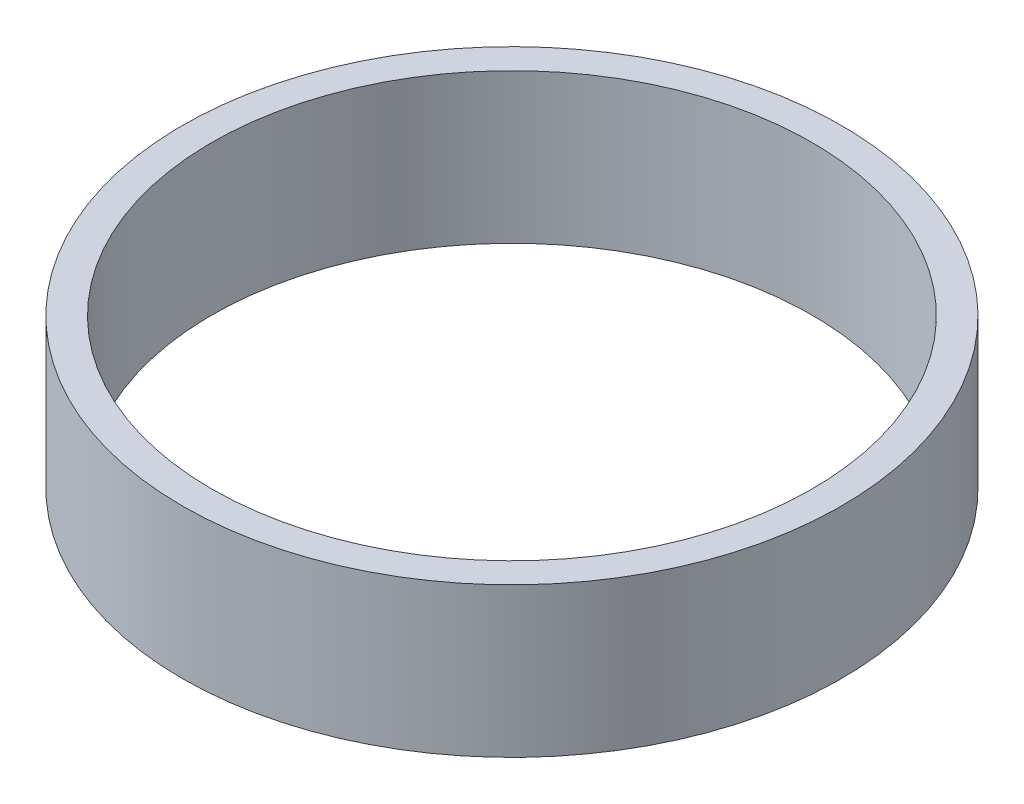
ISO-10303-21;
HEADER;
FILE_DESCRIPTION(('STEP AP214'),'2;1');
FILE_NAME('part.step','',(''),(''),'','','');
FILE_SCHEMA(('AUTOMOTIVE_DESIGN { 1 0 10303 214 1 1 1 1 }'));
ENDSEC;
DATA;
#1=APPLICATION_CONTEXT('core data for automotive mechanical design processes');
#2=APPLICATION_PROTOCOL_DEFINITION('international standard','automotive_design',2000,#1);
#3=PRODUCT_CONTEXT('',#1,'mechanical');
#4=PRODUCT('Part','Part','',(#3));
#5=PRODUCT_RELATED_PRODUCT_CATEGORY('part','',(#4));
#6=PRODUCT_DEFINITION_FORMATION('','',#4);
#7=PRODUCT_DEFINITION_CONTEXT('part definition',#1,'design');
#8=PRODUCT_DEFINITION('design','',#6,#7);
#9=PRODUCT_DEFINITION_SHAPE('','',#8);
#10=(LENGTH_UNIT() NAMED_UNIT(*) SI_UNIT(.MILLI.,.METRE.));
#11=(NAMED_UNIT(*) PLANE_ANGLE_UNIT() SI_UNIT($,.RADIAN.));
#12=(NAMED_UNIT(*) SI_UNIT($,.STERADIAN.) SOLID_ANGLE_UNIT());
#13=UNCERTAINTY_MEASURE_WITH_UNIT(LENGTH_MEASURE(1.E-05),#10,'distance_accuracy_value','');
#14=(GEOMETRIC_REPRESENTATION_CONTEXT(3) GLOBAL_UNCERTAINTY_ASSIGNED_CONTEXT((#13)) GLOBAL_UNIT_ASSIGNED_CONTEXT((#10,
#11,#12)) REPRESENTATION_CONTEXT('',''));
#15=CARTESIAN_POINT('',(0.,0.,0.));
#16=DIRECTION('',(0.,0.,1.));
#17=DIRECTION('',(1.,0.,0.));
#18=AXIS2_PLACEMENT_3D('',#15,#16,#17);
#19=CARTESIAN_POINT('',(25.5,0.,0.));
#20=DIRECTION('',(0.,1.,0.));
#21=DIRECTION('',(0.,0.,1.));
#22=AXIS2_PLACEMENT_3D('',#19,#20,#21);
#23=PLANE('',#22);
#24=CARTESIAN_POINT('',(0.,0.,0.));
#25=DIRECTION('',(0.,1.,0.));
#26=DIRECTION('',(0.,0.,1.));
#27=AXIS2_PLACEMENT_3D('',#24,#25,#26);
#28=CIRCLE('',#27,28.);
#29=CARTESIAN_POINT('',(0.,0.,28.));
#30=VERTEX_POINT('',#29);
#31=EDGE_CURVE('E10',#30,#30,#28,.T.);
#32=ORIENTED_EDGE('',*,*,#31,.F.);
#33=EDGE_LOOP('',(#32));
#34=FACE_BOUND('',#33,.T.);
#35=CARTESIAN_POINT('',(0.,0.,0.));
#36=DIRECTION('',(0.,1.,0.));
#37=DIRECTION('',(0.,0.,1.));
#38=AXIS2_PLACEMENT_3D('',#35,#36,#37);
#39=CIRCLE('',#38,25.5);
#40=CARTESIAN_POINT('',(0.,0.,25.5));
#41=VERTEX_POINT('',#40);
#42=EDGE_CURVE('E51',#41,#41,#39,.T.);
#43=ORIENTED_EDGE('',*,*,#42,.T.);
#44=EDGE_LOOP('',(#43));
#45=FACE_BOUND('',#44,.T.);
#46=ADVANCED_FACE('F37',(#34,#45),#23,.F.);
#47=CARTESIAN_POINT('',(0.,161.376166943427,0.));
#48=DIRECTION('',(0.,1.,0.));
#49=DIRECTION('',(0.,0.,1.));
#50=AXIS2_PLACEMENT_3D('',#47,#48,#49);
#51=CYLINDRICAL_SURFACE('',#50,28.);
#52=CARTESIAN_POINT('',(0.,12.7,0.));
#53=DIRECTION('',(0.,1.,0.));
#54=DIRECTION('',(0.,0.,1.));
#55=AXIS2_PLACEMENT_3D('',#52,#53,#54);
#56=CIRCLE('',#55,28.);
#57=CARTESIAN_POINT('',(0.,12.7,28.));
#58=VERTEX_POINT('',#57);
#59=EDGE_CURVE('E43',#58,#58,#56,.T.);
#60=ORIENTED_EDGE('',*,*,#59,.F.);
#61=EDGE_LOOP('',(#60));
#62=FACE_BOUND('',#61,.T.);
#63=ORIENTED_EDGE('',*,*,#31,.T.);
#64=EDGE_LOOP('',(#63));
#65=FACE_BOUND('',#64,.T.);
#66=ADVANCED_FACE('F66',(#62,#65),#51,.T.);
#67=CARTESIAN_POINT('',(25.5,12.7,0.));
#68=DIRECTION('',(0.,-1.,0.));
#69=DIRECTION('',(0.,0.,-1.));
#70=AXIS2_PLACEMENT_3D('',#67,#68,#69);
#71=PLANE('',#70);
#72=CARTESIAN_POINT('',(0.,12.7,0.));
#73=DIRECTION('',(0.,1.,0.));
#74=DIRECTION('',(0.,0.,1.));
#75=AXIS2_PLACEMENT_3D('',#72,#73,#74);
#76=CIRCLE('',#75,25.5);
#77=CARTESIAN_POINT('',(0.,12.7,25.5));
#78=VERTEX_POINT('',#77);
#79=EDGE_CURVE('E47',#78,#78,#76,.T.);
#80=ORIENTED_EDGE('',*,*,#79,.F.);
#81=EDGE_LOOP('',(#80));
#82=FACE_BOUND('',#81,.T.);
#83=ORIENTED_EDGE('',*,*,#59,.T.);
#84=EDGE_LOOP('',(#83));
#85=FACE_BOUND('',#84,.T.);
#86=ADVANCED_FACE('F61',(#82,#85),#71,.F.);
#87=CARTESIAN_POINT('',(0.,161.376166943427,0.));
#88=DIRECTION('',(0.,1.,0.));
#89=DIRECTION('',(0.,0.,1.));
#90=AXIS2_PLACEMENT_3D('',#87,#88,#89);
#91=CYLINDRICAL_SURFACE('',#90,25.5);
#92=ORIENTED_EDGE('',*,*,#42,.F.);
#93=EDGE_LOOP('',(#92));
#94=FACE_BOUND('',#93,.T.);
#95=ORIENTED_EDGE('',*,*,#79,.T.);
#96=EDGE_LOOP('',(#95));
#97=FACE_BOUND('',#96,.T.);
#98=ADVANCED_FACE('F58',(#94,#97),#91,.F.);
#99=CLOSED_SHELL('',(#46,#66,#86,#98));
#100=MANIFOLD_SOLID_BREP('B2',#99);
#101=ADVANCED_BREP_SHAPE_REPRESENTATION('',(#18,#100),#14);
#102=SHAPE_DEFINITION_REPRESENTATION(#9,#101);
ENDSEC;
END-ISO-10303-21;
